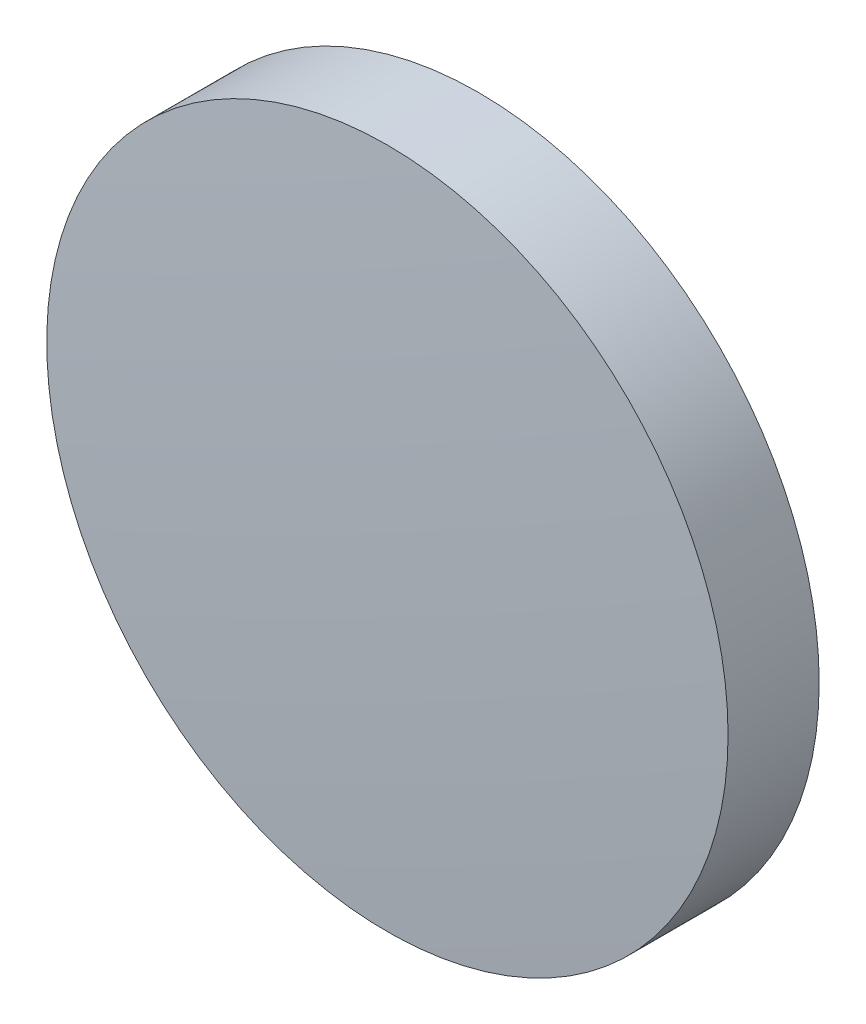
ISO-10303-21;
HEADER;
FILE_DESCRIPTION(('STEP AP214'),'2;1');
FILE_NAME('part.step','',(''),(''),'','','');
FILE_SCHEMA(('AUTOMOTIVE_DESIGN { 1 0 10303 214 1 1 1 1 }'));
ENDSEC;
DATA;
#1=APPLICATION_CONTEXT('core data for automotive mechanical design processes');
#2=APPLICATION_PROTOCOL_DEFINITION('international standard','automotive_design',2000,#1);
#3=PRODUCT_CONTEXT('',#1,'mechanical');
#4=PRODUCT('Part','Part','',(#3));
#5=PRODUCT_RELATED_PRODUCT_CATEGORY('part','',(#4));
#6=PRODUCT_DEFINITION_FORMATION('','',#4);
#7=PRODUCT_DEFINITION_CONTEXT('part definition',#1,'design');
#8=PRODUCT_DEFINITION('design','',#6,#7);
#9=PRODUCT_DEFINITION_SHAPE('','',#8);
#10=(LENGTH_UNIT() NAMED_UNIT(*) SI_UNIT(.MILLI.,.METRE.));
#11=(NAMED_UNIT(*) PLANE_ANGLE_UNIT() SI_UNIT($,.RADIAN.));
#12=(NAMED_UNIT(*) SI_UNIT($,.STERADIAN.) SOLID_ANGLE_UNIT());
#13=UNCERTAINTY_MEASURE_WITH_UNIT(LENGTH_MEASURE(1.E-05),#10,'distance_accuracy_value','');
#14=(GEOMETRIC_REPRESENTATION_CONTEXT(3) GLOBAL_UNCERTAINTY_ASSIGNED_CONTEXT((#13)) GLOBAL_UNIT_ASSIGNED_CONTEXT((#10,
#11,#12)) REPRESENTATION_CONTEXT('',''));
#15=CARTESIAN_POINT('',(0.,0.,0.));
#16=DIRECTION('',(0.,0.,1.));
#17=DIRECTION('',(1.,0.,0.));
#18=AXIS2_PLACEMENT_3D('',#15,#16,#17);
#19=CARTESIAN_POINT('',(0.,0.,-248.140364172042));
#20=DIRECTION('',(0.,0.,1.));
#21=DIRECTION('',(0.,1.,0.));
#22=AXIS2_PLACEMENT_3D('',#19,#20,#21);
#23=SPHERICAL_SURFACE('',#22,250.);
#24=CARTESIAN_POINT('',(0.,0.,1.53684744327572));
#25=DIRECTION('',(0.,0.,1.));
#26=DIRECTION('',(1.,0.,0.));
#27=AXIS2_PLACEMENT_3D('',#24,#25,#26);
#28=CIRCLE('',#27,12.7);
#29=CARTESIAN_POINT('',(12.7,0.,1.53684744327572));
#30=VERTEX_POINT('',#29);
#31=EDGE_CURVE('E8',#30,#30,#28,.T.);
#32=ORIENTED_EDGE('',*,*,#31,.T.);
#33=EDGE_LOOP('',(#32));
#34=FACE_BOUND('',#33,.T.);
#35=ADVANCED_FACE('F12',(#34),#23,.T.);
#36=CARTESIAN_POINT('',(0.,0.,9.26473958279937));
#37=DIRECTION('',(0.,0.,1.));
#38=DIRECTION('',(1.,0.,0.));
#39=AXIS2_PLACEMENT_3D('',#36,#37,#38);
#40=CYLINDRICAL_SURFACE('',#39,12.7);
#41=ORIENTED_EDGE('',*,*,#31,.F.);
#42=EDGE_LOOP('',(#41));
#43=FACE_BOUND('',#42,.T.);
#44=CARTESIAN_POINT('',(0.,0.,-1.85963582795832));
#45=DIRECTION('',(0.,0.,1.));
#46=DIRECTION('',(1.,0.,0.));
#47=AXIS2_PLACEMENT_3D('',#44,#45,#46);
#48=CIRCLE('',#47,12.7);
#49=CARTESIAN_POINT('',(12.7,0.,-1.85963582795832));
#50=VERTEX_POINT('',#49);
#51=EDGE_CURVE('E18',#50,#50,#48,.T.);
#52=ORIENTED_EDGE('',*,*,#51,.T.);
#53=EDGE_LOOP('',(#52));
#54=FACE_BOUND('',#53,.T.);
#55=ADVANCED_FACE('F24',(#43,#54),#40,.T.);
#56=CARTESIAN_POINT('',(0.,0.,-113.620364172042));
#57=DIRECTION('',(0.,0.,1.));
#58=DIRECTION('',(0.,1.,0.));
#59=AXIS2_PLACEMENT_3D('',#56,#57,#58);
#60=SPHERICAL_SURFACE('',#59,112.48);
#61=ORIENTED_EDGE('',*,*,#51,.F.);
#62=EDGE_LOOP('',(#61));
#63=FACE_BOUND('',#62,.T.);
#64=ADVANCED_FACE('F26',(#63),#60,.F.);
#65=CLOSED_SHELL('',(#35,#55,#64));
#66=MANIFOLD_SOLID_BREP('B1',#65);
#67=ADVANCED_BREP_SHAPE_REPRESENTATION('',(#18,#66),#14);
#68=SHAPE_DEFINITION_REPRESENTATION(#9,#67);
ENDSEC;
END-ISO-10303-21;
